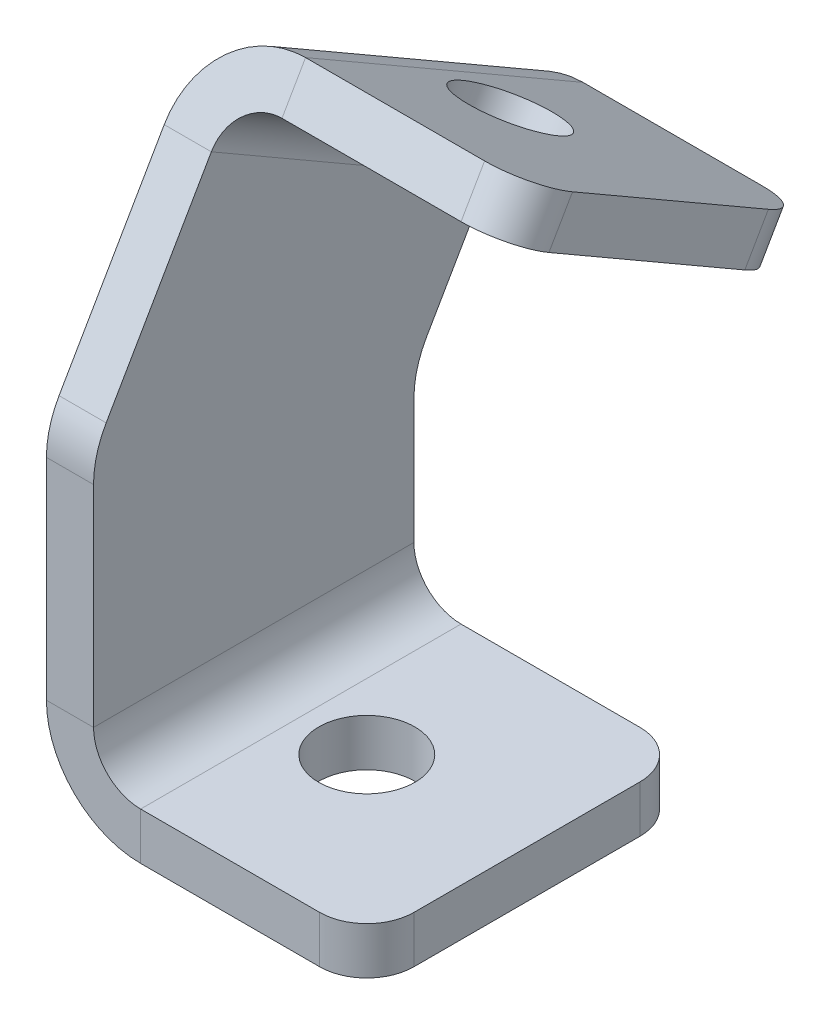
ISO-10303-21;
HEADER;
FILE_DESCRIPTION(('STEP AP214'),'2;1');
FILE_NAME('part.step','',(''),(''),'','','');
FILE_SCHEMA(('AUTOMOTIVE_DESIGN { 1 0 10303 214 1 1 1 1 }'));
ENDSEC;
DATA;
#1=APPLICATION_CONTEXT('core data for automotive mechanical design processes');
#2=APPLICATION_PROTOCOL_DEFINITION('international standard','automotive_design',2000,#1);
#3=PRODUCT_CONTEXT('',#1,'mechanical');
#4=PRODUCT('Part','Part','',(#3));
#5=PRODUCT_RELATED_PRODUCT_CATEGORY('part','',(#4));
#6=PRODUCT_DEFINITION_FORMATION('','',#4);
#7=PRODUCT_DEFINITION_CONTEXT('part definition',#1,'design');
#8=PRODUCT_DEFINITION('design','',#6,#7);
#9=PRODUCT_DEFINITION_SHAPE('','',#8);
#10=(LENGTH_UNIT() NAMED_UNIT(*) SI_UNIT(.MILLI.,.METRE.));
#11=(NAMED_UNIT(*) PLANE_ANGLE_UNIT() SI_UNIT($,.RADIAN.));
#12=(NAMED_UNIT(*) SI_UNIT($,.STERADIAN.) SOLID_ANGLE_UNIT());
#13=UNCERTAINTY_MEASURE_WITH_UNIT(LENGTH_MEASURE(1.E-05),#10,'distance_accuracy_value','');
#14=(GEOMETRIC_REPRESENTATION_CONTEXT(3) GLOBAL_UNCERTAINTY_ASSIGNED_CONTEXT((#13)) GLOBAL_UNIT_ASSIGNED_CONTEXT((#10,
#11,#12)) REPRESENTATION_CONTEXT('',''));
#15=CARTESIAN_POINT('',(0.,0.,0.));
#16=DIRECTION('',(0.,0.,1.));
#17=DIRECTION('',(1.,0.,0.));
#18=AXIS2_PLACEMENT_3D('',#15,#16,#17);
#19=CARTESIAN_POINT('',(2.5,16.1602540378444,12.));
#20=DIRECTION('',(1.,0.,0.));
#21=DIRECTION('',(0.,0.,-1.));
#22=AXIS2_PLACEMENT_3D('',#19,#20,#21);
#23=CYLINDRICAL_SURFACE('',#22,5.);
#24=DIRECTION('',(1.,0.,0.));
#25=VECTOR('',#24,1.);
#26=CARTESIAN_POINT('',(2.5,18.6602540378444,16.3301270189222));
#27=LINE('',#26,#25);
#28=CARTESIAN_POINT('',(0.,18.6602540378444,16.3301270189222));
#29=VERTEX_POINT('',#28);
#30=CARTESIAN_POINT('',(2.5,18.6602540378444,16.3301270189222));
#31=VERTEX_POINT('',#30);
#32=EDGE_CURVE('E10',#29,#31,#27,.T.);
#33=ORIENTED_EDGE('',*,*,#32,.F.);
#34=CARTESIAN_POINT('',(0.,16.1602540378444,12.));
#35=DIRECTION('',(1.,0.,0.));
#36=DIRECTION('',(0.,0.,-1.));
#37=AXIS2_PLACEMENT_3D('',#34,#35,#36);
#38=CIRCLE('',#37,5.);
#39=CARTESIAN_POINT('',(0.,16.1602540378444,17.));
#40=VERTEX_POINT('',#39);
#41=EDGE_CURVE('E136',#29,#40,#38,.T.);
#42=ORIENTED_EDGE('',*,*,#41,.T.);
#43=DIRECTION('',(1.,0.,0.));
#44=VECTOR('',#43,1.);
#45=CARTESIAN_POINT('',(2.5,16.1602540378444,17.));
#46=LINE('',#45,#44);
#47=CARTESIAN_POINT('',(2.5,16.1602540378444,17.));
#48=VERTEX_POINT('',#47);
#49=EDGE_CURVE('E26',#40,#48,#46,.T.);
#50=ORIENTED_EDGE('',*,*,#49,.T.);
#51=CARTESIAN_POINT('',(2.5,16.1602540378444,12.));
#52=DIRECTION('',(1.,0.,0.));
#53=DIRECTION('',(0.,0.,-1.));
#54=AXIS2_PLACEMENT_3D('',#51,#52,#53);
#55=CIRCLE('',#54,5.);
#56=EDGE_CURVE('E254',#31,#48,#55,.T.);
#57=ORIENTED_EDGE('',*,*,#56,.F.);
#58=EDGE_LOOP('',(#33,#42,#50,#57));
#59=FACE_BOUND('',#58,.T.);
#60=ADVANCED_FACE('F16',(#59),#23,.T.);
#61=CARTESIAN_POINT('',(2.5,0.,17.));
#62=DIRECTION('',(0.,0.,-1.));
#63=DIRECTION('',(0.,1.,0.));
#64=AXIS2_PLACEMENT_3D('',#61,#62,#63);
#65=PLANE('',#64);
#66=ORIENTED_EDGE('',*,*,#49,.F.);
#67=DIRECTION('',(0.,1.,0.));
#68=VECTOR('',#67,1.);
#69=CARTESIAN_POINT('',(0.,0.,17.));
#70=LINE('',#69,#68);
#71=CARTESIAN_POINT('',(0.,5.,17.));
#72=VERTEX_POINT('',#71);
#73=EDGE_CURVE('E195',#40,#72,#70,.F.);
#74=ORIENTED_EDGE('',*,*,#73,.T.);
#75=DIRECTION('',(1.,0.,0.));
#76=VECTOR('',#75,1.);
#77=CARTESIAN_POINT('',(2.5,5.,17.));
#78=LINE('',#77,#76);
#79=CARTESIAN_POINT('',(2.5,5.,17.));
#80=VERTEX_POINT('',#79);
#81=EDGE_CURVE('E247',#72,#80,#78,.T.);
#82=ORIENTED_EDGE('',*,*,#81,.T.);
#83=DIRECTION('',(0.,1.,0.));
#84=VECTOR('',#83,1.);
#85=CARTESIAN_POINT('',(2.5,0.,17.));
#86=LINE('',#85,#84);
#87=EDGE_CURVE('E264',#48,#80,#86,.F.);
#88=ORIENTED_EDGE('',*,*,#87,.F.);
#89=EDGE_LOOP('',(#66,#74,#82,#88));
#90=FACE_BOUND('',#89,.T.);
#91=ADVANCED_FACE('F267',(#90),#65,.F.);
#92=CARTESIAN_POINT('',(5.,5.,17.));
#93=DIRECTION('',(0.,0.,1.));
#94=DIRECTION('',(1.,0.,0.));
#95=AXIS2_PLACEMENT_3D('',#92,#93,#94);
#96=PLANE('',#95);
#97=ORIENTED_EDGE('',*,*,#81,.F.);
#98=CARTESIAN_POINT('',(5.,5.,17.));
#99=DIRECTION('',(0.,0.,1.));
#100=DIRECTION('',(1.,0.,0.));
#101=AXIS2_PLACEMENT_3D('',#98,#99,#100);
#102=CIRCLE('',#101,5.);
#103=CARTESIAN_POINT('',(5.,0.,17.));
#104=VERTEX_POINT('',#103);
#105=EDGE_CURVE('E170',#104,#72,#102,.F.);
#106=ORIENTED_EDGE('',*,*,#105,.F.);
#107=DIRECTION('',(0.,1.,0.));
#108=VECTOR('',#107,1.);
#109=CARTESIAN_POINT('',(5.,2.5,17.));
#110=LINE('',#109,#108);
#111=CARTESIAN_POINT('',(5.,2.5,17.));
#112=VERTEX_POINT('',#111);
#113=EDGE_CURVE('E244',#104,#112,#110,.T.);
#114=ORIENTED_EDGE('',*,*,#113,.T.);
#115=CARTESIAN_POINT('',(5.,5.,17.));
#116=DIRECTION('',(0.,0.,-1.));
#117=DIRECTION('',(-1.,0.,0.));
#118=AXIS2_PLACEMENT_3D('',#115,#116,#117);
#119=CIRCLE('',#118,2.5);
#120=EDGE_CURVE('E279',#112,#80,#119,.T.);
#121=ORIENTED_EDGE('',*,*,#120,.T.);
#122=EDGE_LOOP('',(#97,#106,#114,#121));
#123=FACE_BOUND('',#122,.T.);
#124=ADVANCED_FACE('F336',(#123),#96,.T.);
#125=CARTESIAN_POINT('',(0.,2.5,17.));
#126=DIRECTION('',(0.,0.,1.));
#127=DIRECTION('',(1.,0.,0.));
#128=AXIS2_PLACEMENT_3D('',#125,#126,#127);
#129=PLANE('',#128);
#130=ORIENTED_EDGE('',*,*,#113,.F.);
#131=DIRECTION('',(1.,0.,0.));
#132=VECTOR('',#131,1.);
#133=CARTESIAN_POINT('',(0.,0.,17.));
#134=LINE('',#133,#132);
#135=CARTESIAN_POINT('',(14.5,0.,17.));
#136=VERTEX_POINT('',#135);
#137=EDGE_CURVE('E190',#104,#136,#134,.T.);
#138=ORIENTED_EDGE('',*,*,#137,.T.);
#139=DIRECTION('',(0.,1.,0.));
#140=VECTOR('',#139,1.);
#141=CARTESIAN_POINT('',(14.5,2.5,17.));
#142=LINE('',#141,#140);
#143=CARTESIAN_POINT('',(14.5,2.5,17.));
#144=VERTEX_POINT('',#143);
#145=EDGE_CURVE('E241',#136,#144,#142,.T.);
#146=ORIENTED_EDGE('',*,*,#145,.T.);
#147=DIRECTION('',(1.,0.,0.));
#148=VECTOR('',#147,1.);
#149=CARTESIAN_POINT('',(0.,2.5,17.));
#150=LINE('',#149,#148);
#151=EDGE_CURVE('E388',#112,#144,#150,.T.);
#152=ORIENTED_EDGE('',*,*,#151,.F.);
#153=EDGE_LOOP('',(#130,#138,#146,#152));
#154=FACE_BOUND('',#153,.T.);
#155=ADVANCED_FACE('F658',(#154),#129,.T.);
#156=CARTESIAN_POINT('',(14.5,2.5,14.5));
#157=DIRECTION('',(0.,1.,0.));
#158=DIRECTION('',(0.,0.,1.));
#159=AXIS2_PLACEMENT_3D('',#156,#157,#158);
#160=CYLINDRICAL_SURFACE('',#159,2.5);
#161=ORIENTED_EDGE('',*,*,#145,.F.);
#162=CARTESIAN_POINT('',(14.5,0.,14.5));
#163=DIRECTION('',(0.,1.,0.));
#164=DIRECTION('',(0.,0.,1.));
#165=AXIS2_PLACEMENT_3D('',#162,#163,#164);
#166=CIRCLE('',#165,2.5);
#167=CARTESIAN_POINT('',(17.,0.,14.5));
#168=VERTEX_POINT('',#167);
#169=EDGE_CURVE('E166',#136,#168,#166,.T.);
#170=ORIENTED_EDGE('',*,*,#169,.T.);
#171=DIRECTION('',(0.,1.,0.));
#172=VECTOR('',#171,1.);
#173=CARTESIAN_POINT('',(17.,2.5,14.5));
#174=LINE('',#173,#172);
#175=CARTESIAN_POINT('',(17.,2.5,14.5));
#176=VERTEX_POINT('',#175);
#177=EDGE_CURVE('E238',#168,#176,#174,.T.);
#178=ORIENTED_EDGE('',*,*,#177,.T.);
#179=CARTESIAN_POINT('',(14.5,2.5,14.5));
#180=DIRECTION('',(0.,1.,0.));
#181=DIRECTION('',(0.,0.,1.));
#182=AXIS2_PLACEMENT_3D('',#179,#180,#181);
#183=CIRCLE('',#182,2.5);
#184=EDGE_CURVE('E384',#144,#176,#183,.T.);
#185=ORIENTED_EDGE('',*,*,#184,.F.);
#186=EDGE_LOOP('',(#161,#170,#178,#185));
#187=FACE_BOUND('',#186,.T.);
#188=ADVANCED_FACE('F649',(#187),#160,.T.);
#189=CARTESIAN_POINT('',(17.,2.5,17.));
#190=DIRECTION('',(1.,0.,0.));
#191=DIRECTION('',(0.,0.,-1.));
#192=AXIS2_PLACEMENT_3D('',#189,#190,#191);
#193=PLANE('',#192);
#194=ORIENTED_EDGE('',*,*,#177,.F.);
#195=DIRECTION('',(0.,0.,1.));
#196=VECTOR('',#195,1.);
#197=CARTESIAN_POINT('',(17.,0.,17.));
#198=LINE('',#197,#196);
#199=CARTESIAN_POINT('',(17.,0.,2.5));
#200=VERTEX_POINT('',#199);
#201=EDGE_CURVE('E184',#168,#200,#198,.F.);
#202=ORIENTED_EDGE('',*,*,#201,.T.);
#203=DIRECTION('',(0.,1.,0.));
#204=VECTOR('',#203,1.);
#205=CARTESIAN_POINT('',(17.,2.5,2.5));
#206=LINE('',#205,#204);
#207=CARTESIAN_POINT('',(17.,2.5,2.5));
#208=VERTEX_POINT('',#207);
#209=EDGE_CURVE('E235',#200,#208,#206,.T.);
#210=ORIENTED_EDGE('',*,*,#209,.T.);
#211=DIRECTION('',(0.,0.,-1.));
#212=VECTOR('',#211,1.);
#213=CARTESIAN_POINT('',(17.,2.5,17.));
#214=LINE('',#213,#212);
#215=EDGE_CURVE('E401',#176,#208,#214,.T.);
#216=ORIENTED_EDGE('',*,*,#215,.F.);
#217=EDGE_LOOP('',(#194,#202,#210,#216));
#218=FACE_BOUND('',#217,.T.);
#219=ADVANCED_FACE('F640',(#218),#193,.T.);
#220=CARTESIAN_POINT('',(14.5,2.5,2.5));
#221=DIRECTION('',(0.,1.,0.));
#222=DIRECTION('',(0.,0.,1.));
#223=AXIS2_PLACEMENT_3D('',#220,#221,#222);
#224=CYLINDRICAL_SURFACE('',#223,2.5);
#225=ORIENTED_EDGE('',*,*,#209,.F.);
#226=CARTESIAN_POINT('',(14.5,0.,2.5));
#227=DIRECTION('',(0.,1.,0.));
#228=DIRECTION('',(0.,0.,1.));
#229=AXIS2_PLACEMENT_3D('',#226,#227,#228);
#230=CIRCLE('',#229,2.5);
#231=CARTESIAN_POINT('',(14.5,0.,0.));
#232=VERTEX_POINT('',#231);
#233=EDGE_CURVE('E181',#200,#232,#230,.T.);
#234=ORIENTED_EDGE('',*,*,#233,.T.);
#235=DIRECTION('',(0.,1.,0.));
#236=VECTOR('',#235,1.);
#237=CARTESIAN_POINT('',(14.5,2.5,0.));
#238=LINE('',#237,#236);
#239=CARTESIAN_POINT('',(14.5,2.5,0.));
#240=VERTEX_POINT('',#239);
#241=EDGE_CURVE('E232',#232,#240,#238,.T.);
#242=ORIENTED_EDGE('',*,*,#241,.T.);
#243=CARTESIAN_POINT('',(14.5,2.5,2.5));
#244=DIRECTION('',(0.,1.,0.));
#245=DIRECTION('',(0.,0.,1.));
#246=AXIS2_PLACEMENT_3D('',#243,#244,#245);
#247=CIRCLE('',#246,2.5);
#248=EDGE_CURVE('E398',#208,#240,#247,.T.);
#249=ORIENTED_EDGE('',*,*,#248,.F.);
#250=EDGE_LOOP('',(#225,#234,#242,#249));
#251=FACE_BOUND('',#250,.T.);
#252=ADVANCED_FACE('F632',(#251),#224,.T.);
#253=CARTESIAN_POINT('',(0.,2.5,0.));
#254=DIRECTION('',(0.,0.,1.));
#255=DIRECTION('',(1.,0.,0.));
#256=AXIS2_PLACEMENT_3D('',#253,#254,#255);
#257=PLANE('',#256);
#258=ORIENTED_EDGE('',*,*,#241,.F.);
#259=DIRECTION('',(1.,0.,0.));
#260=VECTOR('',#259,1.);
#261=CARTESIAN_POINT('',(0.,0.,0.));
#262=LINE('',#261,#260);
#263=CARTESIAN_POINT('',(5.,0.,0.));
#264=VERTEX_POINT('',#263);
#265=EDGE_CURVE('E178',#264,#232,#262,.T.);
#266=ORIENTED_EDGE('',*,*,#265,.F.);
#267=DIRECTION('',(0.,1.,0.));
#268=VECTOR('',#267,1.);
#269=CARTESIAN_POINT('',(5.,2.5,0.));
#270=LINE('',#269,#268);
#271=CARTESIAN_POINT('',(5.,2.5,0.));
#272=VERTEX_POINT('',#271);
#273=EDGE_CURVE('E229',#264,#272,#270,.T.);
#274=ORIENTED_EDGE('',*,*,#273,.T.);
#275=DIRECTION('',(1.,0.,0.));
#276=VECTOR('',#275,1.);
#277=CARTESIAN_POINT('',(0.,2.5,0.));
#278=LINE('',#277,#276);
#279=EDGE_CURVE('E396',#272,#240,#278,.T.);
#280=ORIENTED_EDGE('',*,*,#279,.T.);
#281=EDGE_LOOP('',(#258,#266,#274,#280));
#282=FACE_BOUND('',#281,.T.);
#283=ADVANCED_FACE('F624',(#282),#257,.F.);
#284=CARTESIAN_POINT('',(5.,5.,0.));
#285=DIRECTION('',(0.,0.,1.));
#286=DIRECTION('',(1.,0.,0.));
#287=AXIS2_PLACEMENT_3D('',#284,#285,#286);
#288=PLANE('',#287);
#289=ORIENTED_EDGE('',*,*,#273,.F.);
#290=CARTESIAN_POINT('',(5.,5.,0.));
#291=DIRECTION('',(0.,0.,1.));
#292=DIRECTION('',(1.,0.,0.));
#293=AXIS2_PLACEMENT_3D('',#290,#291,#292);
#294=CIRCLE('',#293,5.);
#295=CARTESIAN_POINT('',(0.,5.,0.));
#296=VERTEX_POINT('',#295);
#297=EDGE_CURVE('E175',#296,#264,#294,.T.);
#298=ORIENTED_EDGE('',*,*,#297,.F.);
#299=DIRECTION('',(1.,0.,0.));
#300=VECTOR('',#299,1.);
#301=CARTESIAN_POINT('',(2.5,5.,0.));
#302=LINE('',#301,#300);
#303=CARTESIAN_POINT('',(2.5,5.,0.));
#304=VERTEX_POINT('',#303);
#305=EDGE_CURVE('E226',#296,#304,#302,.T.);
#306=ORIENTED_EDGE('',*,*,#305,.T.);
#307=CARTESIAN_POINT('',(5.,5.,0.));
#308=DIRECTION('',(0.,0.,-1.));
#309=DIRECTION('',(-1.,0.,0.));
#310=AXIS2_PLACEMENT_3D('',#307,#308,#309);
#311=CIRCLE('',#310,2.5);
#312=EDGE_CURVE('E281',#304,#272,#311,.F.);
#313=ORIENTED_EDGE('',*,*,#312,.T.);
#314=EDGE_LOOP('',(#289,#298,#306,#313));
#315=FACE_BOUND('',#314,.T.);
#316=ADVANCED_FACE('F319',(#315),#288,.F.);
#317=CARTESIAN_POINT('',(2.5,0.,0.));
#318=DIRECTION('',(0.,0.,-1.));
#319=DIRECTION('',(0.,1.,0.));
#320=AXIS2_PLACEMENT_3D('',#317,#318,#319);
#321=PLANE('',#320);
#322=ORIENTED_EDGE('',*,*,#305,.F.);
#323=DIRECTION('',(0.,1.,0.));
#324=VECTOR('',#323,1.);
#325=CARTESIAN_POINT('',(0.,0.,0.));
#326=LINE('',#325,#324);
#327=CARTESIAN_POINT('',(0.,11.6051177665153,0.));
#328=VERTEX_POINT('',#327);
#329=EDGE_CURVE('E171',#328,#296,#326,.F.);
#330=ORIENTED_EDGE('',*,*,#329,.F.);
#331=DIRECTION('',(1.,0.,0.));
#332=VECTOR('',#331,1.);
#333=CARTESIAN_POINT('',(2.5,11.6051177665153,0.));
#334=LINE('',#333,#332);
#335=CARTESIAN_POINT('',(2.5,11.6051177665153,0.));
#336=VERTEX_POINT('',#335);
#337=EDGE_CURVE('E223',#328,#336,#334,.T.);
#338=ORIENTED_EDGE('',*,*,#337,.T.);
#339=DIRECTION('',(0.,1.,0.));
#340=VECTOR('',#339,1.);
#341=CARTESIAN_POINT('',(2.5,0.,0.));
#342=LINE('',#341,#340);
#343=EDGE_CURVE('E270',#336,#304,#342,.F.);
#344=ORIENTED_EDGE('',*,*,#343,.T.);
#345=EDGE_LOOP('',(#322,#330,#338,#344));
#346=FACE_BOUND('',#345,.T.);
#347=ADVANCED_FACE('F608',(#346),#321,.T.);
#348=CARTESIAN_POINT('',(2.5,11.6051177665153,-5.));
#349=DIRECTION('',(1.,0.,0.));
#350=DIRECTION('',(0.,0.,-1.));
#351=AXIS2_PLACEMENT_3D('',#348,#349,#350);
#352=CYLINDRICAL_SURFACE('',#351,5.);
#353=ORIENTED_EDGE('',*,*,#337,.F.);
#354=CARTESIAN_POINT('',(0.,11.6051177665153,-5.));
#355=DIRECTION('',(1.,0.,0.));
#356=DIRECTION('',(0.,0.,-1.));
#357=AXIS2_PLACEMENT_3D('',#354,#355,#356);
#358=CIRCLE('',#357,5.);
#359=CARTESIAN_POINT('',(0.,14.1051177665153,-0.669872981077811));
#360=VERTEX_POINT('',#359);
#361=EDGE_CURVE('E167',#328,#360,#358,.F.);
#362=ORIENTED_EDGE('',*,*,#361,.T.);
#363=DIRECTION('',(1.,0.,0.));
#364=VECTOR('',#363,1.);
#365=CARTESIAN_POINT('',(2.5,14.1051177665153,-0.669872981077813));
#366=LINE('',#365,#364);
#367=CARTESIAN_POINT('',(2.5,14.1051177665153,-0.669872981077813));
#368=VERTEX_POINT('',#367);
#369=EDGE_CURVE('E220',#360,#368,#366,.T.);
#370=ORIENTED_EDGE('',*,*,#369,.T.);
#371=CARTESIAN_POINT('',(2.5,11.6051177665153,-5.));
#372=DIRECTION('',(1.,0.,0.));
#373=DIRECTION('',(0.,0.,-1.));
#374=AXIS2_PLACEMENT_3D('',#371,#372,#373);
#375=CIRCLE('',#374,5.);
#376=EDGE_CURVE('E276',#336,#368,#375,.F.);
#377=ORIENTED_EDGE('',*,*,#376,.F.);
#378=EDGE_LOOP('',(#353,#362,#370,#377));
#379=FACE_BOUND('',#378,.T.);
#380=ADVANCED_FACE('F600',(#379),#352,.F.);
#381=CARTESIAN_POINT('',(2.5,24.1554445662277,-6.47243186433547));
#382=DIRECTION('',(0.,0.500000000000001,0.866025403784438));
#383=DIRECTION('',(0.,-0.866025403784438,0.500000000000001));
#384=AXIS2_PLACEMENT_3D('',#381,#382,#383);
#385=PLANE('',#384);
#386=ORIENTED_EDGE('',*,*,#369,.F.);
#387=DIRECTION('',(0.,-0.866025403784438,0.500000000000001));
#388=VECTOR('',#387,1.);
#389=CARTESIAN_POINT('',(0.,24.1554445662277,-6.47243186433547));
#390=LINE('',#389,#388);
#391=CARTESIAN_POINT('',(0.,19.8253175473055,-3.97243186433546));
#392=VERTEX_POINT('',#391);
#393=EDGE_CURVE('E132',#360,#392,#390,.F.);
#394=ORIENTED_EDGE('',*,*,#393,.T.);
#395=DIRECTION('',(1.,0.,0.));
#396=VECTOR('',#395,1.);
#397=CARTESIAN_POINT('',(2.5,19.8253175473055,-3.97243186433546));
#398=LINE('',#397,#396);
#399=CARTESIAN_POINT('',(2.5,19.8253175473055,-3.97243186433546));
#400=VERTEX_POINT('',#399);
#401=EDGE_CURVE('E217',#392,#400,#398,.T.);
#402=ORIENTED_EDGE('',*,*,#401,.T.);
#403=DIRECTION('',(0.,-0.866025403784438,0.500000000000001));
#404=VECTOR('',#403,1.);
#405=CARTESIAN_POINT('',(2.5,24.1554445662277,-6.47243186433547));
#406=LINE('',#405,#404);
#407=EDGE_CURVE('E380',#368,#400,#406,.F.);
#408=ORIENTED_EDGE('',*,*,#407,.F.);
#409=EDGE_LOOP('',(#386,#394,#402,#408));
#410=FACE_BOUND('',#409,.T.);
#411=ADVANCED_FACE('F379',(#410),#385,.F.);
#412=CARTESIAN_POINT('',(5.,19.8253175473055,-3.97243186433547));
#413=DIRECTION('',(0.,0.500000000000001,0.866025403784438));
#414=DIRECTION('',(0.,-0.866025403784438,0.500000000000001));
#415=AXIS2_PLACEMENT_3D('',#412,#413,#414);
#416=PLANE('',#415);
#417=ORIENTED_EDGE('',*,*,#401,.F.);
#418=CARTESIAN_POINT('',(5.,19.8253175473055,-3.97243186433546));
#419=DIRECTION('',(0.,0.500000000000001,0.866025403784438));
#420=DIRECTION('',(0.,-0.866025403784438,0.500000000000001));
#421=AXIS2_PLACEMENT_3D('',#418,#419,#420);
#422=CIRCLE('',#421,5.);
#423=CARTESIAN_POINT('',(5.,24.1554445662277,-6.47243186433547));
#424=VERTEX_POINT('',#423);
#425=EDGE_CURVE('E128',#424,#392,#422,.T.);
#426=ORIENTED_EDGE('',*,*,#425,.F.);
#427=DIRECTION('',(0.,-0.866025403784438,0.500000000000001));
#428=VECTOR('',#427,1.);
#429=CARTESIAN_POINT('',(5.,21.9903810567666,-5.22243186433547));
#430=LINE('',#429,#428);
#431=CARTESIAN_POINT('',(5.,21.9903810567666,-5.22243186433547));
#432=VERTEX_POINT('',#431);
#433=EDGE_CURVE('E34',#424,#432,#430,.T.);
#434=ORIENTED_EDGE('',*,*,#433,.T.);
#435=CARTESIAN_POINT('',(5.,19.8253175473055,-3.97243186433547));
#436=DIRECTION('',(0.,-0.500000000000001,-0.866025403784438));
#437=DIRECTION('',(0.,0.866025403784438,-0.500000000000001));
#438=AXIS2_PLACEMENT_3D('',#435,#436,#437);
#439=CIRCLE('',#438,2.5);
#440=EDGE_CURVE('E118',#432,#400,#439,.F.);
#441=ORIENTED_EDGE('',*,*,#440,.T.);
#442=EDGE_LOOP('',(#417,#426,#434,#441));
#443=FACE_BOUND('',#442,.T.);
#444=ADVANCED_FACE('F373',(#443),#416,.F.);
#445=CARTESIAN_POINT('',(0.,21.9903810567666,-5.22243186433547));
#446=DIRECTION('',(0.,-0.500000000000001,-0.866025403784438));
#447=DIRECTION('',(1.,0.,0.));
#448=AXIS2_PLACEMENT_3D('',#445,#446,#447);
#449=PLANE('',#448);
#450=ORIENTED_EDGE('',*,*,#433,.F.);
#451=DIRECTION('',(-1.,0.,0.));
#452=VECTOR('',#451,1.);
#453=CARTESIAN_POINT('',(0.,24.1554445662277,-6.47243186433547));
#454=LINE('',#453,#452);
#455=CARTESIAN_POINT('',(14.5,24.1554445662277,-6.47243186433547));
#456=VERTEX_POINT('',#455);
#457=EDGE_CURVE('E161',#424,#456,#454,.F.);
#458=ORIENTED_EDGE('',*,*,#457,.T.);
#459=DIRECTION('',(0.,-0.866025403784438,0.500000000000001));
#460=VECTOR('',#459,1.);
#461=CARTESIAN_POINT('',(14.5,21.9903810567666,-5.22243186433547));
#462=LINE('',#461,#460);
#463=CARTESIAN_POINT('',(14.5,21.9903810567666,-5.22243186433547));
#464=VERTEX_POINT('',#463);
#465=EDGE_CURVE('E213',#456,#464,#462,.T.);
#466=ORIENTED_EDGE('',*,*,#465,.T.);
#467=DIRECTION('',(1.,0.,0.));
#468=VECTOR('',#467,1.);
#469=CARTESIAN_POINT('',(0.,21.9903810567666,-5.22243186433547));
#470=LINE('',#469,#468);
#471=EDGE_CURVE('E287',#432,#464,#470,.T.);
#472=ORIENTED_EDGE('',*,*,#471,.F.);
#473=EDGE_LOOP('',(#450,#458,#466,#472));
#474=FACE_BOUND('',#473,.T.);
#475=ADVANCED_FACE('F577',(#474),#449,.T.);
#476=CARTESIAN_POINT('',(14.5,23.2403810567666,-3.05736835487437));
#477=DIRECTION('',(0.,-0.866025403784438,0.500000000000001));
#478=DIRECTION('',(0.,-0.500000000000001,-0.866025403784438));
#479=AXIS2_PLACEMENT_3D('',#476,#477,#478);
#480=CYLINDRICAL_SURFACE('',#479,2.5);
#481=ORIENTED_EDGE('',*,*,#465,.F.);
#482=CARTESIAN_POINT('',(14.5,25.4054445662277,-4.30736835487437));
#483=DIRECTION('',(0.,-0.866025403784438,0.500000000000001));
#484=DIRECTION('',(0.,-0.500000000000001,-0.866025403784438));
#485=AXIS2_PLACEMENT_3D('',#482,#483,#484);
#486=CIRCLE('',#485,2.5);
#487=CARTESIAN_POINT('',(17.,25.4054445662277,-4.30736835487437));
#488=VERTEX_POINT('',#487);
#489=EDGE_CURVE('E158',#456,#488,#486,.T.);
#490=ORIENTED_EDGE('',*,*,#489,.T.);
#491=DIRECTION('',(0.,-0.866025403784438,0.500000000000001));
#492=VECTOR('',#491,1.);
#493=CARTESIAN_POINT('',(17.,23.2403810567666,-3.05736835487437));
#494=LINE('',#493,#492);
#495=CARTESIAN_POINT('',(17.,23.2403810567666,-3.05736835487437));
#496=VERTEX_POINT('',#495);
#497=EDGE_CURVE('E210',#488,#496,#494,.T.);
#498=ORIENTED_EDGE('',*,*,#497,.T.);
#499=CARTESIAN_POINT('',(14.5,23.2403810567666,-3.05736835487437));
#500=DIRECTION('',(0.,-0.866025403784438,0.500000000000001));
#501=DIRECTION('',(0.,-0.500000000000001,-0.866025403784438));
#502=AXIS2_PLACEMENT_3D('',#499,#500,#501);
#503=CIRCLE('',#502,2.5);
#504=EDGE_CURVE('E290',#464,#496,#503,.T.);
#505=ORIENTED_EDGE('',*,*,#504,.F.);
#506=EDGE_LOOP('',(#481,#490,#498,#505));
#507=FACE_BOUND('',#506,.T.);
#508=ADVANCED_FACE('F568',(#507),#480,.T.);
#509=CARTESIAN_POINT('',(17.,30.4903810567666,9.49999999999998));
#510=DIRECTION('',(-1.,0.,0.));
#511=DIRECTION('',(0.,-0.500000000000001,-0.866025403784438));
#512=AXIS2_PLACEMENT_3D('',#509,#510,#511);
#513=PLANE('',#512);
#514=ORIENTED_EDGE('',*,*,#497,.F.);
#515=DIRECTION('',(0.,0.500000000000001,0.866025403784438));
#516=VECTOR('',#515,1.);
#517=CARTESIAN_POINT('',(17.,32.6554445662277,8.24999999999998));
#518=LINE('',#517,#516);
#519=CARTESIAN_POINT('',(17.,31.4054445662277,6.08493649053888));
#520=VERTEX_POINT('',#519);
#521=EDGE_CURVE('E155',#520,#488,#518,.F.);
#522=ORIENTED_EDGE('',*,*,#521,.F.);
#523=DIRECTION('',(0.,-0.866025403784438,0.500000000000001));
#524=VECTOR('',#523,1.);
#525=CARTESIAN_POINT('',(17.,29.2403810567666,7.33493649053889));
#526=LINE('',#525,#524);
#527=CARTESIAN_POINT('',(17.,29.2403810567666,7.33493649053889));
#528=VERTEX_POINT('',#527);
#529=EDGE_CURVE('E207',#520,#528,#526,.T.);
#530=ORIENTED_EDGE('',*,*,#529,.T.);
#531=DIRECTION('',(0.,-0.500000000000001,-0.866025403784438));
#532=VECTOR('',#531,1.);
#533=CARTESIAN_POINT('',(17.,30.4903810567666,9.49999999999998));
#534=LINE('',#533,#532);
#535=EDGE_CURVE('E293',#528,#496,#534,.T.);
#536=ORIENTED_EDGE('',*,*,#535,.T.);
#537=EDGE_LOOP('',(#514,#522,#530,#536));
#538=FACE_BOUND('',#537,.T.);
#539=ADVANCED_FACE('F560',(#538),#513,.F.);
#540=CARTESIAN_POINT('',(14.5,29.2403810567666,7.33493649053889));
#541=DIRECTION('',(0.,-0.866025403784438,0.500000000000001));
#542=DIRECTION('',(0.,-0.500000000000001,-0.866025403784438));
#543=AXIS2_PLACEMENT_3D('',#540,#541,#542);
#544=CYLINDRICAL_SURFACE('',#543,2.5);
#545=ORIENTED_EDGE('',*,*,#529,.F.);
#546=CARTESIAN_POINT('',(14.5,31.4054445662277,6.08493649053888));
#547=DIRECTION('',(0.,-0.866025403784438,0.500000000000001));
#548=DIRECTION('',(0.,-0.500000000000001,-0.866025403784438));
#549=AXIS2_PLACEMENT_3D('',#546,#547,#548);
#550=CIRCLE('',#549,2.5);
#551=CARTESIAN_POINT('',(14.5,32.6554445662277,8.24999999999998));
#552=VERTEX_POINT('',#551);
#553=EDGE_CURVE('E152',#520,#552,#550,.T.);
#554=ORIENTED_EDGE('',*,*,#553,.T.);
#555=DIRECTION('',(0.,-0.866025403784438,0.500000000000001));
#556=VECTOR('',#555,1.);
#557=CARTESIAN_POINT('',(14.5,30.4903810567666,9.49999999999998));
#558=LINE('',#557,#556);
#559=CARTESIAN_POINT('',(14.5,30.4903810567666,9.49999999999998));
#560=VERTEX_POINT('',#559);
#561=EDGE_CURVE('E204',#552,#560,#558,.T.);
#562=ORIENTED_EDGE('',*,*,#561,.T.);
#563=CARTESIAN_POINT('',(14.5,29.2403810567666,7.33493649053889));
#564=DIRECTION('',(0.,-0.866025403784438,0.500000000000001));
#565=DIRECTION('',(0.,-0.500000000000001,-0.866025403784438));
#566=AXIS2_PLACEMENT_3D('',#563,#564,#565);
#567=CIRCLE('',#566,2.5);
#568=EDGE_CURVE('E296',#528,#560,#567,.T.);
#569=ORIENTED_EDGE('',*,*,#568,.F.);
#570=EDGE_LOOP('',(#545,#554,#562,#569));
#571=FACE_BOUND('',#570,.T.);
#572=ADVANCED_FACE('F359',(#571),#544,.T.);
#573=CARTESIAN_POINT('',(0.,30.4903810567666,9.49999999999998));
#574=DIRECTION('',(0.,-0.500000000000001,-0.866025403784438));
#575=DIRECTION('',(1.,0.,0.));
#576=AXIS2_PLACEMENT_3D('',#573,#574,#575);
#577=PLANE('',#576);
#578=ORIENTED_EDGE('',*,*,#561,.F.);
#579=DIRECTION('',(-1.,0.,0.));
#580=VECTOR('',#579,1.);
#581=CARTESIAN_POINT('',(0.,32.6554445662277,8.24999999999998));
#582=LINE('',#581,#580);
#583=CARTESIAN_POINT('',(5.,32.6554445662277,8.24999999999998));
#584=VERTEX_POINT('',#583);
#585=EDGE_CURVE('E144',#584,#552,#582,.F.);
#586=ORIENTED_EDGE('',*,*,#585,.F.);
#587=DIRECTION('',(0.,-0.866025403784438,0.500000000000001));
#588=VECTOR('',#587,1.);
#589=CARTESIAN_POINT('',(5.,30.4903810567666,9.49999999999998));
#590=LINE('',#589,#588);
#591=CARTESIAN_POINT('',(5.,30.4903810567666,9.49999999999998));
#592=VERTEX_POINT('',#591);
#593=EDGE_CURVE('E117',#584,#592,#590,.T.);
#594=ORIENTED_EDGE('',*,*,#593,.T.);
#595=DIRECTION('',(1.,0.,0.));
#596=VECTOR('',#595,1.);
#597=CARTESIAN_POINT('',(0.,30.4903810567666,9.49999999999998));
#598=LINE('',#597,#596);
#599=EDGE_CURVE('E299',#592,#560,#598,.T.);
#600=ORIENTED_EDGE('',*,*,#599,.T.);
#601=EDGE_LOOP('',(#578,#586,#594,#600));
#602=FACE_BOUND('',#601,.T.);
#603=ADVANCED_FACE('F366',(#602),#577,.F.);
#604=CARTESIAN_POINT('',(5.,28.3253175473055,10.75));
#605=DIRECTION('',(0.,0.500000000000001,0.866025403784438));
#606=DIRECTION('',(0.,-0.866025403784438,0.500000000000001));
#607=AXIS2_PLACEMENT_3D('',#604,#605,#606);
#608=PLANE('',#607);
#609=ORIENTED_EDGE('',*,*,#593,.F.);
#610=CARTESIAN_POINT('',(5.,28.3253175473055,10.75));
#611=DIRECTION('',(0.,0.500000000000001,0.866025403784438));
#612=DIRECTION('',(0.,-0.866025403784438,0.500000000000001));
#613=AXIS2_PLACEMENT_3D('',#610,#611,#612);
#614=CIRCLE('',#613,5.);
#615=CARTESIAN_POINT('',(0.,28.3253175473055,10.75));
#616=VERTEX_POINT('',#615);
#617=EDGE_CURVE('E126',#616,#584,#614,.F.);
#618=ORIENTED_EDGE('',*,*,#617,.F.);
#619=DIRECTION('',(1.,0.,0.));
#620=VECTOR('',#619,1.);
#621=CARTESIAN_POINT('',(2.5,28.3253175473055,10.75));
#622=LINE('',#621,#620);
#623=CARTESIAN_POINT('',(2.5,28.3253175473055,10.75));
#624=VERTEX_POINT('',#623);
#625=EDGE_CURVE('E20',#616,#624,#622,.T.);
#626=ORIENTED_EDGE('',*,*,#625,.T.);
#627=CARTESIAN_POINT('',(5.,28.3253175473055,10.75));
#628=DIRECTION('',(0.,-0.500000000000001,-0.866025403784438));
#629=DIRECTION('',(0.,0.866025403784438,-0.500000000000001));
#630=AXIS2_PLACEMENT_3D('',#627,#628,#629);
#631=CIRCLE('',#630,2.5);
#632=EDGE_CURVE('E305',#624,#592,#631,.T.);
#633=ORIENTED_EDGE('',*,*,#632,.T.);
#634=EDGE_LOOP('',(#609,#618,#626,#633));
#635=FACE_BOUND('',#634,.T.);
#636=ADVANCED_FACE('F138',(#635),#608,.T.);
#637=CARTESIAN_POINT('',(8.5,2.5,8.5));
#638=DIRECTION('',(0.,1.,0.));
#639=DIRECTION('',(0.,0.,1.));
#640=AXIS2_PLACEMENT_3D('',#637,#638,#639);
#641=CYLINDRICAL_SURFACE('',#640,2.55);
#642=CARTESIAN_POINT('',(8.5,2.5,8.5));
#643=DIRECTION('',(0.,1.,0.));
#644=DIRECTION('',(0.,0.,1.));
#645=AXIS2_PLACEMENT_3D('',#642,#643,#644);
#646=CIRCLE('',#645,2.55);
#647=CARTESIAN_POINT('',(8.5,2.5,11.05));
#648=VERTEX_POINT('',#647);
#649=EDGE_CURVE('E142',#648,#648,#646,.F.);
#650=ORIENTED_EDGE('',*,*,#649,.F.);
#651=EDGE_LOOP('',(#650));
#652=FACE_BOUND('',#651,.T.);
#653=CARTESIAN_POINT('',(8.5,0.,8.5));
#654=DIRECTION('',(0.,1.,0.));
#655=DIRECTION('',(0.,0.,1.));
#656=AXIS2_PLACEMENT_3D('',#653,#654,#655);
#657=CIRCLE('',#656,2.55);
#658=CARTESIAN_POINT('',(8.5,0.,11.05));
#659=VERTEX_POINT('',#658);
#660=EDGE_CURVE('E187',#659,#659,#657,.F.);
#661=ORIENTED_EDGE('',*,*,#660,.T.);
#662=EDGE_LOOP('',(#661));
#663=FACE_BOUND('',#662,.T.);
#664=ADVANCED_FACE('F18',(#652,#663),#641,.F.);
#665=CARTESIAN_POINT('',(8.5,26.2403810567666,2.13878406783226));
#666=DIRECTION('',(0.,-0.866025403784438,0.500000000000001));
#667=DIRECTION('',(0.,-0.500000000000001,-0.866025403784438));
#668=AXIS2_PLACEMENT_3D('',#665,#666,#667);
#669=CYLINDRICAL_SURFACE('',#668,2.55);
#670=CARTESIAN_POINT('',(8.5,26.2403810567666,2.13878406783226));
#671=DIRECTION('',(0.,0.866025403784438,-0.500000000000001));
#672=DIRECTION('',(0.,0.500000000000001,0.866025403784438));
#673=AXIS2_PLACEMENT_3D('',#670,#671,#672);
#674=CIRCLE('',#673,2.55);
#675=CARTESIAN_POINT('',(8.5,27.5153810567666,4.34714884748258));
#676=VERTEX_POINT('',#675);
#677=EDGE_CURVE('E284',#676,#676,#674,.F.);
#678=ORIENTED_EDGE('',*,*,#677,.T.);
#679=EDGE_LOOP('',(#678));
#680=FACE_BOUND('',#679,.T.);
#681=CARTESIAN_POINT('',(8.5,28.4054445662277,0.888784067832256));
#682=DIRECTION('',(0.,0.866025403784438,-0.500000000000001));
#683=DIRECTION('',(0.,0.500000000000001,0.866025403784438));
#684=AXIS2_PLACEMENT_3D('',#681,#682,#683);
#685=CIRCLE('',#684,2.55);
#686=CARTESIAN_POINT('',(8.5,29.6804445662277,3.09714884748257));
#687=VERTEX_POINT('',#686);
#688=EDGE_CURVE('E163',#687,#687,#685,.F.);
#689=ORIENTED_EDGE('',*,*,#688,.F.);
#690=EDGE_LOOP('',(#689));
#691=FACE_BOUND('',#690,.T.);
#692=ADVANCED_FACE('F412',(#680,#691),#669,.F.);
#693=CARTESIAN_POINT('',(2.5,32.6554445662277,8.24999999999998));
#694=DIRECTION('',(0.,0.500000000000001,0.866025403784438));
#695=DIRECTION('',(0.,-0.866025403784438,0.500000000000001));
#696=AXIS2_PLACEMENT_3D('',#693,#694,#695);
#697=PLANE('',#696);
#698=DIRECTION('',(0.,-0.866025403784438,0.500000000000001));
#699=VECTOR('',#698,1.);
#700=CARTESIAN_POINT('',(0.,32.6554445662277,8.24999999999998));
#701=LINE('',#700,#699);
#702=EDGE_CURVE('E108',#29,#616,#701,.F.);
#703=ORIENTED_EDGE('',*,*,#702,.F.);
#704=ORIENTED_EDGE('',*,*,#32,.T.);
#705=DIRECTION('',(0.,-0.866025403784438,0.500000000000001));
#706=VECTOR('',#705,1.);
#707=CARTESIAN_POINT('',(2.5,32.6554445662277,8.24999999999998));
#708=LINE('',#707,#706);
#709=EDGE_CURVE('E111',#31,#624,#708,.F.);
#710=ORIENTED_EDGE('',*,*,#709,.T.);
#711=ORIENTED_EDGE('',*,*,#625,.F.);
#712=EDGE_LOOP('',(#703,#704,#710,#711));
#713=FACE_BOUND('',#712,.T.);
#714=ADVANCED_FACE('F106',(#713),#697,.T.);
#715=CARTESIAN_POINT('',(5.,28.3253175473055,10.75));
#716=DIRECTION('',(0.,0.500000000000001,0.866025403784438));
#717=DIRECTION('',(0.,-0.866025403784438,0.500000000000001));
#718=AXIS2_PLACEMENT_3D('',#715,#716,#717);
#719=CYLINDRICAL_SURFACE('',#718,2.5);
#720=ORIENTED_EDGE('',*,*,#632,.F.);
#721=DIRECTION('',(0.,-0.500000000000001,-0.866025403784438));
#722=VECTOR('',#721,1.);
#723=CARTESIAN_POINT('',(2.5,28.3253175473055,10.75));
#724=LINE('',#723,#722);
#725=EDGE_CURVE('E383',#400,#624,#724,.F.);
#726=ORIENTED_EDGE('',*,*,#725,.F.);
#727=ORIENTED_EDGE('',*,*,#440,.F.);
#728=DIRECTION('',(0.,-0.500000000000001,-0.866025403784438));
#729=VECTOR('',#728,1.);
#730=CARTESIAN_POINT('',(5.,21.9903810567666,-5.22243186433547));
#731=LINE('',#730,#729);
#732=EDGE_CURVE('E302',#592,#432,#731,.T.);
#733=ORIENTED_EDGE('',*,*,#732,.F.);
#734=EDGE_LOOP('',(#720,#726,#727,#733));
#735=FACE_BOUND('',#734,.T.);
#736=ADVANCED_FACE('F432',(#735),#719,.F.);
#737=CARTESIAN_POINT('',(0.,30.4903810567666,9.49999999999998));
#738=DIRECTION('',(0.,-0.866025403784438,0.500000000000001));
#739=DIRECTION('',(0.,0.500000000000001,0.866025403784438));
#740=AXIS2_PLACEMENT_3D('',#737,#738,#739);
#741=PLANE('',#740);
#742=ORIENTED_EDGE('',*,*,#677,.F.);
#743=EDGE_LOOP('',(#742));
#744=FACE_BOUND('',#743,.T.);
#745=ORIENTED_EDGE('',*,*,#471,.T.);
#746=ORIENTED_EDGE('',*,*,#504,.T.);
#747=ORIENTED_EDGE('',*,*,#535,.F.);
#748=ORIENTED_EDGE('',*,*,#568,.T.);
#749=ORIENTED_EDGE('',*,*,#599,.F.);
#750=ORIENTED_EDGE('',*,*,#732,.T.);
#751=EDGE_LOOP('',(#745,#746,#747,#748,#749,#750));
#752=FACE_BOUND('',#751,.T.);
#753=ADVANCED_FACE('F365',(#744,#752),#741,.T.);
#754=CARTESIAN_POINT('',(5.,5.,17.));
#755=DIRECTION('',(0.,0.,1.));
#756=DIRECTION('',(1.,0.,0.));
#757=AXIS2_PLACEMENT_3D('',#754,#755,#756);
#758=CYLINDRICAL_SURFACE('',#757,2.5);
#759=ORIENTED_EDGE('',*,*,#120,.F.);
#760=DIRECTION('',(0.,0.,-1.));
#761=VECTOR('',#760,1.);
#762=CARTESIAN_POINT('',(5.,2.5,17.));
#763=LINE('',#762,#761);
#764=EDGE_CURVE('E393',#272,#112,#763,.F.);
#765=ORIENTED_EDGE('',*,*,#764,.F.);
#766=ORIENTED_EDGE('',*,*,#312,.F.);
#767=DIRECTION('',(0.,0.,-1.));
#768=VECTOR('',#767,1.);
#769=CARTESIAN_POINT('',(2.5,5.,0.));
#770=LINE('',#769,#768);
#771=EDGE_CURVE('E268',#80,#304,#770,.T.);
#772=ORIENTED_EDGE('',*,*,#771,.F.);
#773=EDGE_LOOP('',(#759,#765,#766,#772));
#774=FACE_BOUND('',#773,.T.);
#775=ADVANCED_FACE('F343',(#774),#758,.F.);
#776=CARTESIAN_POINT('',(2.5,0.,17.));
#777=DIRECTION('',(1.,0.,0.));
#778=DIRECTION('',(0.,0.,-1.));
#779=AXIS2_PLACEMENT_3D('',#776,#777,#778);
#780=PLANE('',#779);
#781=ORIENTED_EDGE('',*,*,#407,.T.);
#782=ORIENTED_EDGE('',*,*,#725,.T.);
#783=ORIENTED_EDGE('',*,*,#709,.F.);
#784=ORIENTED_EDGE('',*,*,#56,.T.);
#785=ORIENTED_EDGE('',*,*,#87,.T.);
#786=ORIENTED_EDGE('',*,*,#771,.T.);
#787=ORIENTED_EDGE('',*,*,#343,.F.);
#788=ORIENTED_EDGE('',*,*,#376,.T.);
#789=EDGE_LOOP('',(#781,#782,#783,#784,#785,#786,#787,#788));
#790=FACE_BOUND('',#789,.T.);
#791=ADVANCED_FACE('F262',(#790),#780,.T.);
#792=CARTESIAN_POINT('',(0.,2.5,17.));
#793=DIRECTION('',(0.,1.,0.));
#794=DIRECTION('',(0.,0.,1.));
#795=AXIS2_PLACEMENT_3D('',#792,#793,#794);
#796=PLANE('',#795);
#797=ORIENTED_EDGE('',*,*,#649,.T.);
#798=EDGE_LOOP('',(#797));
#799=FACE_BOUND('',#798,.T.);
#800=ORIENTED_EDGE('',*,*,#215,.T.);
#801=ORIENTED_EDGE('',*,*,#248,.T.);
#802=ORIENTED_EDGE('',*,*,#279,.F.);
#803=ORIENTED_EDGE('',*,*,#764,.T.);
#804=ORIENTED_EDGE('',*,*,#151,.T.);
#805=ORIENTED_EDGE('',*,*,#184,.T.);
#806=EDGE_LOOP('',(#800,#801,#802,#803,#804,#805));
#807=FACE_BOUND('',#806,.T.);
#808=ADVANCED_FACE('F407',(#799,#807),#796,.T.);
#809=CARTESIAN_POINT('',(5.,28.3253175473055,10.75));
#810=DIRECTION('',(0.,0.500000000000001,0.866025403784438));
#811=DIRECTION('',(0.,-0.866025403784438,0.500000000000001));
#812=AXIS2_PLACEMENT_3D('',#809,#810,#811);
#813=CYLINDRICAL_SURFACE('',#812,5.);
#814=ORIENTED_EDGE('',*,*,#617,.T.);
#815=DIRECTION('',(0.,0.500000000000001,0.866025403784438));
#816=VECTOR('',#815,1.);
#817=CARTESIAN_POINT('',(5.,32.6554445662277,8.24999999999998));
#818=LINE('',#817,#816);
#819=EDGE_CURVE('E140',#584,#424,#818,.F.);
#820=ORIENTED_EDGE('',*,*,#819,.T.);
#821=ORIENTED_EDGE('',*,*,#425,.T.);
#822=DIRECTION('',(0.,0.500000000000001,0.866025403784438));
#823=VECTOR('',#822,1.);
#824=CARTESIAN_POINT('',(0.,28.3253175473055,10.75));
#825=LINE('',#824,#823);
#826=EDGE_CURVE('E123',#392,#616,#825,.T.);
#827=ORIENTED_EDGE('',*,*,#826,.T.);
#828=EDGE_LOOP('',(#814,#820,#821,#827));
#829=FACE_BOUND('',#828,.T.);
#830=ADVANCED_FACE('F124',(#829),#813,.T.);
#831=CARTESIAN_POINT('',(0.,32.6554445662277,8.24999999999998));
#832=DIRECTION('',(0.,-0.866025403784438,0.500000000000001));
#833=DIRECTION('',(0.,0.500000000000001,0.866025403784438));
#834=AXIS2_PLACEMENT_3D('',#831,#832,#833);
#835=PLANE('',#834);
#836=ORIENTED_EDGE('',*,*,#688,.T.);
#837=EDGE_LOOP('',(#836));
#838=FACE_BOUND('',#837,.T.);
#839=ORIENTED_EDGE('',*,*,#457,.F.);
#840=ORIENTED_EDGE('',*,*,#819,.F.);
#841=ORIENTED_EDGE('',*,*,#585,.T.);
#842=ORIENTED_EDGE('',*,*,#553,.F.);
#843=ORIENTED_EDGE('',*,*,#521,.T.);
#844=ORIENTED_EDGE('',*,*,#489,.F.);
#845=EDGE_LOOP('',(#839,#840,#841,#842,#843,#844));
#846=FACE_BOUND('',#845,.T.);
#847=ADVANCED_FACE('F369',(#838,#846),#835,.F.);
#848=CARTESIAN_POINT('',(5.,5.,17.));
#849=DIRECTION('',(0.,0.,1.));
#850=DIRECTION('',(1.,0.,0.));
#851=AXIS2_PLACEMENT_3D('',#848,#849,#850);
#852=CYLINDRICAL_SURFACE('',#851,5.);
#853=ORIENTED_EDGE('',*,*,#105,.T.);
#854=DIRECTION('',(0.,0.,-1.));
#855=VECTOR('',#854,1.);
#856=CARTESIAN_POINT('',(0.,5.,17.));
#857=LINE('',#856,#855);
#858=EDGE_CURVE('E174',#72,#296,#857,.T.);
#859=ORIENTED_EDGE('',*,*,#858,.T.);
#860=ORIENTED_EDGE('',*,*,#297,.T.);
#861=DIRECTION('',(0.,0.,1.));
#862=VECTOR('',#861,1.);
#863=CARTESIAN_POINT('',(5.,0.,17.));
#864=LINE('',#863,#862);
#865=EDGE_CURVE('E148',#264,#104,#864,.T.);
#866=ORIENTED_EDGE('',*,*,#865,.T.);
#867=EDGE_LOOP('',(#853,#859,#860,#866));
#868=FACE_BOUND('',#867,.T.);
#869=ADVANCED_FACE('F310',(#868),#852,.T.);
#870=CARTESIAN_POINT('',(0.,0.,17.));
#871=DIRECTION('',(1.,0.,0.));
#872=DIRECTION('',(0.,0.,-1.));
#873=AXIS2_PLACEMENT_3D('',#870,#871,#872);
#874=PLANE('',#873);
#875=ORIENTED_EDGE('',*,*,#393,.F.);
#876=ORIENTED_EDGE('',*,*,#361,.F.);
#877=ORIENTED_EDGE('',*,*,#329,.T.);
#878=ORIENTED_EDGE('',*,*,#858,.F.);
#879=ORIENTED_EDGE('',*,*,#73,.F.);
#880=ORIENTED_EDGE('',*,*,#41,.F.);
#881=ORIENTED_EDGE('',*,*,#702,.T.);
#882=ORIENTED_EDGE('',*,*,#826,.F.);
#883=EDGE_LOOP('',(#875,#876,#877,#878,#879,#880,#881,#882));
#884=FACE_BOUND('',#883,.T.);
#885=ADVANCED_FACE('F134',(#884),#874,.F.);
#886=CARTESIAN_POINT('',(0.,0.,17.));
#887=DIRECTION('',(0.,1.,0.));
#888=DIRECTION('',(0.,0.,1.));
#889=AXIS2_PLACEMENT_3D('',#886,#887,#888);
#890=PLANE('',#889);
#891=ORIENTED_EDGE('',*,*,#660,.F.);
#892=EDGE_LOOP('',(#891));
#893=FACE_BOUND('',#892,.T.);
#894=ORIENTED_EDGE('',*,*,#201,.F.);
#895=ORIENTED_EDGE('',*,*,#169,.F.);
#896=ORIENTED_EDGE('',*,*,#137,.F.);
#897=ORIENTED_EDGE('',*,*,#865,.F.);
#898=ORIENTED_EDGE('',*,*,#265,.T.);
#899=ORIENTED_EDGE('',*,*,#233,.F.);
#900=EDGE_LOOP('',(#894,#895,#896,#897,#898,#899));
#901=FACE_BOUND('',#900,.T.);
#902=ADVANCED_FACE('F331',(#893,#901),#890,.F.);
#903=CLOSED_SHELL('',(#60,#91,#124,#155,#188,#219,#252,#283,#316,#347,#380,#411,#444,#475,#508,
#539,#572,#603,#636,#664,#692,#714,#736,#753,#775,#791,#808,#830,#847,#869,#885,#902));
#904=MANIFOLD_SOLID_BREP('B1',#903);
#905=ADVANCED_BREP_SHAPE_REPRESENTATION('',(#18,#904),#14);
#906=SHAPE_DEFINITION_REPRESENTATION(#9,#905);
ENDSEC;
END-ISO-10303-21;
